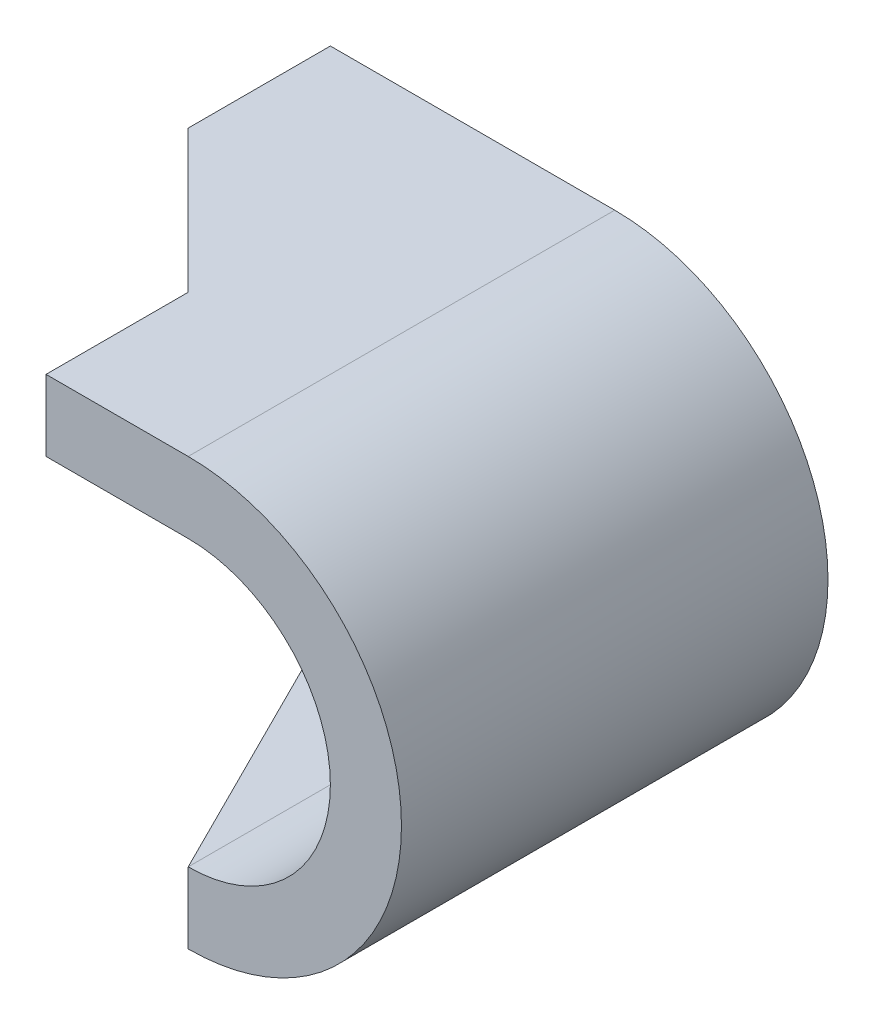
ISO-10303-21;
HEADER;
FILE_DESCRIPTION(('STEP AP214'),'2;1');
FILE_NAME('part.step','',(''),(''),'','','');
FILE_SCHEMA(('AUTOMOTIVE_DESIGN { 1 0 10303 214 1 1 1 1 }'));
ENDSEC;
DATA;
#1=APPLICATION_CONTEXT('core data for automotive mechanical design processes');
#2=APPLICATION_PROTOCOL_DEFINITION('international standard','automotive_design',2000,#1);
#3=PRODUCT_CONTEXT('',#1,'mechanical');
#4=PRODUCT('Part','Part','',(#3));
#5=PRODUCT_RELATED_PRODUCT_CATEGORY('part','',(#4));
#6=PRODUCT_DEFINITION_FORMATION('','',#4);
#7=PRODUCT_DEFINITION_CONTEXT('part definition',#1,'design');
#8=PRODUCT_DEFINITION('design','',#6,#7);
#9=PRODUCT_DEFINITION_SHAPE('','',#8);
#10=(LENGTH_UNIT() NAMED_UNIT(*) SI_UNIT(.MILLI.,.METRE.));
#11=(NAMED_UNIT(*) PLANE_ANGLE_UNIT() SI_UNIT($,.RADIAN.));
#12=(NAMED_UNIT(*) SI_UNIT($,.STERADIAN.) SOLID_ANGLE_UNIT());
#13=UNCERTAINTY_MEASURE_WITH_UNIT(LENGTH_MEASURE(1.E-05),#10,'distance_accuracy_value','');
#14=(GEOMETRIC_REPRESENTATION_CONTEXT(3) GLOBAL_UNCERTAINTY_ASSIGNED_CONTEXT((#13)) GLOBAL_UNIT_ASSIGNED_CONTEXT((#10,
#11,#12)) REPRESENTATION_CONTEXT('',''));
#15=CARTESIAN_POINT('',(0.,0.,0.));
#16=DIRECTION('',(0.,0.,1.));
#17=DIRECTION('',(1.,0.,0.));
#18=AXIS2_PLACEMENT_3D('',#15,#16,#17);
#19=CARTESIAN_POINT('',(0.,0.,6.));
#20=DIRECTION('',(0.,0.,-1.));
#21=DIRECTION('',(-1.,0.,0.));
#22=AXIS2_PLACEMENT_3D('',#19,#20,#21);
#23=CYLINDRICAL_SURFACE('',#22,2.);
#24=CARTESIAN_POINT('',(0.,0.,0.));
#25=DIRECTION('',(0.,0.,-1.));
#26=DIRECTION('',(-1.,0.,0.));
#27=AXIS2_PLACEMENT_3D('',#24,#25,#26);
#28=CIRCLE('',#27,2.);
#29=CARTESIAN_POINT('',(0.,2.,0.));
#30=VERTEX_POINT('',#29);
#31=CARTESIAN_POINT('',(0.,-2.,0.));
#32=VERTEX_POINT('',#31);
#33=EDGE_CURVE('E164',#30,#32,#28,.T.);
#34=ORIENTED_EDGE('',*,*,#33,.T.);
#35=DIRECTION('',(0.,0.,-1.));
#36=VECTOR('',#35,1.);
#37=CARTESIAN_POINT('',(0.,-2.,6.));
#38=LINE('',#37,#36);
#39=CARTESIAN_POINT('',(0.,-2.,6.));
#40=VERTEX_POINT('',#39);
#41=EDGE_CURVE('E39',#40,#32,#38,.T.);
#42=ORIENTED_EDGE('',*,*,#41,.F.);
#43=CARTESIAN_POINT('',(0.,0.,6.));
#44=DIRECTION('',(0.,0.,-1.));
#45=DIRECTION('',(-1.,0.,0.));
#46=AXIS2_PLACEMENT_3D('',#43,#44,#45);
#47=CIRCLE('',#46,2.);
#48=CARTESIAN_POINT('',(0.,2.,6.));
#49=VERTEX_POINT('',#48);
#50=EDGE_CURVE('E150',#49,#40,#47,.T.);
#51=ORIENTED_EDGE('',*,*,#50,.F.);
#52=DIRECTION('',(0.,0.,-1.));
#53=VECTOR('',#52,1.);
#54=CARTESIAN_POINT('',(0.,2.,6.));
#55=LINE('',#54,#53);
#56=EDGE_CURVE('E147',#49,#30,#55,.T.);
#57=ORIENTED_EDGE('',*,*,#56,.T.);
#58=EDGE_LOOP('',(#34,#42,#51,#57));
#59=FACE_BOUND('',#58,.T.);
#60=ADVANCED_FACE('F32',(#59),#23,.F.);
#61=CARTESIAN_POINT('',(0.,-2.,6.));
#62=DIRECTION('',(0.,-1.,0.));
#63=DIRECTION('',(1.,0.,0.));
#64=AXIS2_PLACEMENT_3D('',#61,#62,#63);
#65=PLANE('',#64);
#66=DIRECTION('',(0.,0.,-1.));
#67=VECTOR('',#66,1.);
#68=CARTESIAN_POINT('',(-2.,-2.,6.));
#69=LINE('',#68,#67);
#70=CARTESIAN_POINT('',(-2.,-2.,2.));
#71=VERTEX_POINT('',#70);
#72=CARTESIAN_POINT('',(-2.,-2.,0.));
#73=VERTEX_POINT('',#72);
#74=EDGE_CURVE('E127',#71,#73,#69,.T.);
#75=ORIENTED_EDGE('',*,*,#74,.F.);
#76=DIRECTION('',(0.447213595499958,0.,0.894427190999916));
#77=VECTOR('',#76,1.);
#78=CARTESIAN_POINT('',(0.,-2.,6.));
#79=LINE('',#78,#77);
#80=EDGE_CURVE('E114',#71,#40,#79,.T.);
#81=ORIENTED_EDGE('',*,*,#80,.T.);
#82=ORIENTED_EDGE('',*,*,#41,.T.);
#83=DIRECTION('',(-1.,0.,0.));
#84=VECTOR('',#83,1.);
#85=CARTESIAN_POINT('',(0.,-2.,0.));
#86=LINE('',#85,#84);
#87=EDGE_CURVE('E132',#32,#73,#86,.T.);
#88=ORIENTED_EDGE('',*,*,#87,.T.);
#89=EDGE_LOOP('',(#75,#81,#82,#88));
#90=FACE_BOUND('',#89,.T.);
#91=ADVANCED_FACE('F131',(#90),#65,.F.);
#92=CARTESIAN_POINT('',(-2.,-2.,6.));
#93=DIRECTION('',(1.,0.,0.));
#94=DIRECTION('',(0.,1.,0.));
#95=AXIS2_PLACEMENT_3D('',#92,#93,#94);
#96=PLANE('',#95);
#97=DIRECTION('',(0.,0.,-1.));
#98=VECTOR('',#97,1.);
#99=CARTESIAN_POINT('',(-2.,-3.,6.));
#100=LINE('',#99,#98);
#101=CARTESIAN_POINT('',(-2.,-3.,2.));
#102=VERTEX_POINT('',#101);
#103=CARTESIAN_POINT('',(-2.,-3.,0.));
#104=VERTEX_POINT('',#103);
#105=EDGE_CURVE('E129',#102,#104,#100,.T.);
#106=ORIENTED_EDGE('',*,*,#105,.F.);
#107=DIRECTION('',(0.,-1.,0.));
#108=VECTOR('',#107,1.);
#109=CARTESIAN_POINT('',(-2.,-2.,2.));
#110=LINE('',#109,#108);
#111=EDGE_CURVE('E117',#71,#102,#110,.T.);
#112=ORIENTED_EDGE('',*,*,#111,.F.);
#113=ORIENTED_EDGE('',*,*,#74,.T.);
#114=DIRECTION('',(0.,-1.,0.));
#115=VECTOR('',#114,1.);
#116=CARTESIAN_POINT('',(-2.,-2.,0.));
#117=LINE('',#116,#115);
#118=EDGE_CURVE('E161',#73,#104,#117,.T.);
#119=ORIENTED_EDGE('',*,*,#118,.T.);
#120=EDGE_LOOP('',(#106,#112,#113,#119));
#121=FACE_BOUND('',#120,.T.);
#122=ADVANCED_FACE('F125',(#121),#96,.F.);
#123=CARTESIAN_POINT('',(-2.,-3.,6.));
#124=DIRECTION('',(0.,1.,0.));
#125=DIRECTION('',(-1.,0.,0.));
#126=AXIS2_PLACEMENT_3D('',#123,#124,#125);
#127=PLANE('',#126);
#128=DIRECTION('',(0.,0.,-1.));
#129=VECTOR('',#128,1.);
#130=CARTESIAN_POINT('',(0.,-3.,6.));
#131=LINE('',#130,#129);
#132=CARTESIAN_POINT('',(0.,-3.,6.));
#133=VERTEX_POINT('',#132);
#134=CARTESIAN_POINT('',(0.,-3.,0.));
#135=VERTEX_POINT('',#134);
#136=EDGE_CURVE('E135',#133,#135,#131,.T.);
#137=ORIENTED_EDGE('',*,*,#136,.F.);
#138=DIRECTION('',(0.447213595499958,0.,0.894427190999916));
#139=VECTOR('',#138,1.);
#140=CARTESIAN_POINT('',(0.,-3.,6.));
#141=LINE('',#140,#139);
#142=EDGE_CURVE('E92',#102,#133,#141,.T.);
#143=ORIENTED_EDGE('',*,*,#142,.F.);
#144=ORIENTED_EDGE('',*,*,#105,.T.);
#145=DIRECTION('',(1.,0.,0.));
#146=VECTOR('',#145,1.);
#147=CARTESIAN_POINT('',(-2.,-3.,0.));
#148=LINE('',#147,#146);
#149=EDGE_CURVE('E159',#104,#135,#148,.T.);
#150=ORIENTED_EDGE('',*,*,#149,.T.);
#151=EDGE_LOOP('',(#137,#143,#144,#150));
#152=FACE_BOUND('',#151,.T.);
#153=ADVANCED_FACE('F196',(#152),#127,.F.);
#154=CARTESIAN_POINT('',(0.,0.,6.));
#155=DIRECTION('',(0.,0.,-1.));
#156=DIRECTION('',(-1.,0.,0.));
#157=AXIS2_PLACEMENT_3D('',#154,#155,#156);
#158=CYLINDRICAL_SURFACE('',#157,3.);
#159=CARTESIAN_POINT('',(0.,0.,0.));
#160=DIRECTION('',(0.,0.,1.));
#161=DIRECTION('',(-1.,0.,0.));
#162=AXIS2_PLACEMENT_3D('',#159,#160,#161);
#163=CIRCLE('',#162,3.);
#164=CARTESIAN_POINT('',(0.,3.,0.));
#165=VERTEX_POINT('',#164);
#166=EDGE_CURVE('E157',#135,#165,#163,.T.);
#167=ORIENTED_EDGE('',*,*,#166,.T.);
#168=DIRECTION('',(0.,0.,-1.));
#169=VECTOR('',#168,1.);
#170=CARTESIAN_POINT('',(0.,3.,6.));
#171=LINE('',#170,#169);
#172=CARTESIAN_POINT('',(0.,3.,6.));
#173=VERTEX_POINT('',#172);
#174=EDGE_CURVE('E140',#173,#165,#171,.T.);
#175=ORIENTED_EDGE('',*,*,#174,.F.);
#176=CARTESIAN_POINT('',(0.,0.,6.));
#177=DIRECTION('',(0.,0.,1.));
#178=DIRECTION('',(-1.,0.,0.));
#179=AXIS2_PLACEMENT_3D('',#176,#177,#178);
#180=CIRCLE('',#179,3.);
#181=EDGE_CURVE('E172',#133,#173,#180,.T.);
#182=ORIENTED_EDGE('',*,*,#181,.F.);
#183=ORIENTED_EDGE('',*,*,#136,.T.);
#184=EDGE_LOOP('',(#167,#175,#182,#183));
#185=FACE_BOUND('',#184,.T.);
#186=ADVANCED_FACE('F200',(#185),#158,.T.);
#187=CARTESIAN_POINT('',(-4.,3.,6.));
#188=DIRECTION('',(0.,-1.,0.));
#189=DIRECTION('',(1.,0.,0.));
#190=AXIS2_PLACEMENT_3D('',#187,#188,#189);
#191=PLANE('',#190);
#192=DIRECTION('',(0.707106781186547,0.,0.707106781186548));
#193=VECTOR('',#192,1.);
#194=CARTESIAN_POINT('',(-2.,3.,4.));
#195=LINE('',#194,#193);
#196=CARTESIAN_POINT('',(-4.,3.,2.));
#197=VERTEX_POINT('',#196);
#198=CARTESIAN_POINT('',(-2.,3.,4.));
#199=VERTEX_POINT('',#198);
#200=EDGE_CURVE('E167',#197,#199,#195,.T.);
#201=ORIENTED_EDGE('',*,*,#200,.T.);
#202=DIRECTION('',(0.,0.,1.));
#203=VECTOR('',#202,1.);
#204=CARTESIAN_POINT('',(-2.,3.,6.));
#205=LINE('',#204,#203);
#206=CARTESIAN_POINT('',(-2.,3.,6.));
#207=VERTEX_POINT('',#206);
#208=EDGE_CURVE('E177',#199,#207,#205,.T.);
#209=ORIENTED_EDGE('',*,*,#208,.T.);
#210=DIRECTION('',(-1.,0.,0.));
#211=VECTOR('',#210,1.);
#212=CARTESIAN_POINT('',(-4.,3.,6.));
#213=LINE('',#212,#211);
#214=EDGE_CURVE('E169',#173,#207,#213,.T.);
#215=ORIENTED_EDGE('',*,*,#214,.F.);
#216=ORIENTED_EDGE('',*,*,#174,.T.);
#217=DIRECTION('',(-1.,0.,0.));
#218=VECTOR('',#217,1.);
#219=CARTESIAN_POINT('',(-4.,3.,0.));
#220=LINE('',#219,#218);
#221=CARTESIAN_POINT('',(-4.,3.,0.));
#222=VERTEX_POINT('',#221);
#223=EDGE_CURVE('E154',#165,#222,#220,.T.);
#224=ORIENTED_EDGE('',*,*,#223,.T.);
#225=DIRECTION('',(0.,0.,-1.));
#226=VECTOR('',#225,1.);
#227=CARTESIAN_POINT('',(-4.,3.,6.));
#228=LINE('',#227,#226);
#229=EDGE_CURVE('E143',#197,#222,#228,.T.);
#230=ORIENTED_EDGE('',*,*,#229,.F.);
#231=EDGE_LOOP('',(#201,#209,#215,#216,#224,#230));
#232=FACE_BOUND('',#231,.T.);
#233=ADVANCED_FACE('F204',(#232),#191,.F.);
#234=CARTESIAN_POINT('',(-4.,2.,6.));
#235=DIRECTION('',(1.,0.,0.));
#236=DIRECTION('',(0.,0.,-1.));
#237=AXIS2_PLACEMENT_3D('',#234,#235,#236);
#238=PLANE('',#237);
#239=DIRECTION('',(0.,0.,-1.));
#240=VECTOR('',#239,1.);
#241=CARTESIAN_POINT('',(-4.,2.,6.));
#242=LINE('',#241,#240);
#243=CARTESIAN_POINT('',(-4.,2.,2.));
#244=VERTEX_POINT('',#243);
#245=CARTESIAN_POINT('',(-4.,2.,0.));
#246=VERTEX_POINT('',#245);
#247=EDGE_CURVE('E145',#244,#246,#242,.T.);
#248=ORIENTED_EDGE('',*,*,#247,.F.);
#249=DIRECTION('',(0.,-1.,0.));
#250=VECTOR('',#249,1.);
#251=CARTESIAN_POINT('',(-4.,8.,2.));
#252=LINE('',#251,#250);
#253=EDGE_CURVE('E181',#197,#244,#252,.T.);
#254=ORIENTED_EDGE('',*,*,#253,.F.);
#255=ORIENTED_EDGE('',*,*,#229,.T.);
#256=DIRECTION('',(0.,-1.,0.));
#257=VECTOR('',#256,1.);
#258=CARTESIAN_POINT('',(-4.,2.,0.));
#259=LINE('',#258,#257);
#260=EDGE_CURVE('E151',#222,#246,#259,.T.);
#261=ORIENTED_EDGE('',*,*,#260,.T.);
#262=EDGE_LOOP('',(#248,#254,#255,#261));
#263=FACE_BOUND('',#262,.T.);
#264=ADVANCED_FACE('F216',(#263),#238,.F.);
#265=CARTESIAN_POINT('',(0.,2.,6.));
#266=DIRECTION('',(0.,1.,0.));
#267=DIRECTION('',(-1.,0.,0.));
#268=AXIS2_PLACEMENT_3D('',#265,#266,#267);
#269=PLANE('',#268);
#270=DIRECTION('',(1.,0.,0.));
#271=VECTOR('',#270,1.);
#272=CARTESIAN_POINT('',(0.,2.,6.));
#273=LINE('',#272,#271);
#274=CARTESIAN_POINT('',(-2.,2.,6.));
#275=VERTEX_POINT('',#274);
#276=EDGE_CURVE('E53',#275,#49,#273,.T.);
#277=ORIENTED_EDGE('',*,*,#276,.F.);
#278=DIRECTION('',(0.,0.,1.));
#279=VECTOR('',#278,1.);
#280=CARTESIAN_POINT('',(-2.,2.,6.));
#281=LINE('',#280,#279);
#282=CARTESIAN_POINT('',(-2.,2.,4.));
#283=VERTEX_POINT('',#282);
#284=EDGE_CURVE('E46',#283,#275,#281,.T.);
#285=ORIENTED_EDGE('',*,*,#284,.F.);
#286=DIRECTION('',(0.707106781186547,0.,0.707106781186548));
#287=VECTOR('',#286,1.);
#288=CARTESIAN_POINT('',(-2.,2.,4.));
#289=LINE('',#288,#287);
#290=EDGE_CURVE('E185',#244,#283,#289,.T.);
#291=ORIENTED_EDGE('',*,*,#290,.F.);
#292=ORIENTED_EDGE('',*,*,#247,.T.);
#293=DIRECTION('',(1.,0.,0.));
#294=VECTOR('',#293,1.);
#295=CARTESIAN_POINT('',(0.,2.,0.));
#296=LINE('',#295,#294);
#297=EDGE_CURVE('E85',#246,#30,#296,.T.);
#298=ORIENTED_EDGE('',*,*,#297,.T.);
#299=ORIENTED_EDGE('',*,*,#56,.F.);
#300=EDGE_LOOP('',(#277,#285,#291,#292,#298,#299));
#301=FACE_BOUND('',#300,.T.);
#302=ADVANCED_FACE('F205',(#301),#269,.F.);
#303=CARTESIAN_POINT('',(0.,0.,6.));
#304=DIRECTION('',(0.,0.,-1.));
#305=DIRECTION('',(-1.,0.,0.));
#306=AXIS2_PLACEMENT_3D('',#303,#304,#305);
#307=PLANE('',#306);
#308=ORIENTED_EDGE('',*,*,#50,.T.);
#309=DIRECTION('',(0.,-1.,0.));
#310=VECTOR('',#309,1.);
#311=CARTESIAN_POINT('',(0.,-2.,6.));
#312=LINE('',#311,#310);
#313=EDGE_CURVE('E118',#40,#133,#312,.T.);
#314=ORIENTED_EDGE('',*,*,#313,.T.);
#315=ORIENTED_EDGE('',*,*,#181,.T.);
#316=ORIENTED_EDGE('',*,*,#214,.T.);
#317=DIRECTION('',(0.,-1.,0.));
#318=VECTOR('',#317,1.);
#319=CARTESIAN_POINT('',(-2.,0.,6.));
#320=LINE('',#319,#318);
#321=EDGE_CURVE('E11',#207,#275,#320,.T.);
#322=ORIENTED_EDGE('',*,*,#321,.T.);
#323=ORIENTED_EDGE('',*,*,#276,.T.);
#324=EDGE_LOOP('',(#308,#314,#315,#316,#322,#323));
#325=FACE_BOUND('',#324,.T.);
#326=ADVANCED_FACE('F190',(#325),#307,.F.);
#327=CARTESIAN_POINT('',(0.,0.,0.));
#328=DIRECTION('',(0.,0.,-1.));
#329=DIRECTION('',(-1.,0.,0.));
#330=AXIS2_PLACEMENT_3D('',#327,#328,#329);
#331=PLANE('',#330);
#332=ORIENTED_EDGE('',*,*,#33,.F.);
#333=ORIENTED_EDGE('',*,*,#297,.F.);
#334=ORIENTED_EDGE('',*,*,#260,.F.);
#335=ORIENTED_EDGE('',*,*,#223,.F.);
#336=ORIENTED_EDGE('',*,*,#166,.F.);
#337=ORIENTED_EDGE('',*,*,#149,.F.);
#338=ORIENTED_EDGE('',*,*,#118,.F.);
#339=ORIENTED_EDGE('',*,*,#87,.F.);
#340=EDGE_LOOP('',(#332,#333,#334,#335,#336,#337,#338,#339));
#341=FACE_BOUND('',#340,.T.);
#342=ADVANCED_FACE('F210',(#341),#331,.T.);
#343=CARTESIAN_POINT('',(-2.,8.,4.));
#344=DIRECTION('',(0.707106781186548,0.,-0.707106781186547));
#345=DIRECTION('',(-0.707106781186547,0.,-0.707106781186548));
#346=AXIS2_PLACEMENT_3D('',#343,#344,#345);
#347=PLANE('',#346);
#348=ORIENTED_EDGE('',*,*,#253,.T.);
#349=ORIENTED_EDGE('',*,*,#290,.T.);
#350=DIRECTION('',(0.,-1.,0.));
#351=VECTOR('',#350,1.);
#352=CARTESIAN_POINT('',(-2.,8.,4.));
#353=LINE('',#352,#351);
#354=EDGE_CURVE('E180',#199,#283,#353,.T.);
#355=ORIENTED_EDGE('',*,*,#354,.F.);
#356=ORIENTED_EDGE('',*,*,#200,.F.);
#357=EDGE_LOOP('',(#348,#349,#355,#356));
#358=FACE_BOUND('',#357,.T.);
#359=ADVANCED_FACE('F218',(#358),#347,.F.);
#360=CARTESIAN_POINT('',(-2.,8.,6.));
#361=DIRECTION('',(1.,0.,0.));
#362=DIRECTION('',(0.,1.,0.));
#363=AXIS2_PLACEMENT_3D('',#360,#361,#362);
#364=PLANE('',#363);
#365=ORIENTED_EDGE('',*,*,#354,.T.);
#366=ORIENTED_EDGE('',*,*,#284,.T.);
#367=ORIENTED_EDGE('',*,*,#321,.F.);
#368=ORIENTED_EDGE('',*,*,#208,.F.);
#369=EDGE_LOOP('',(#365,#366,#367,#368));
#370=FACE_BOUND('',#369,.T.);
#371=ADVANCED_FACE('F220',(#370),#364,.F.);
#372=CARTESIAN_POINT('',(0.,-2.,6.));
#373=DIRECTION('',(0.894427190999916,0.,-0.447213595499958));
#374=DIRECTION('',(-0.447213595499958,0.,-0.894427190999916));
#375=AXIS2_PLACEMENT_3D('',#372,#373,#374);
#376=PLANE('',#375);
#377=ORIENTED_EDGE('',*,*,#142,.T.);
#378=ORIENTED_EDGE('',*,*,#313,.F.);
#379=ORIENTED_EDGE('',*,*,#80,.F.);
#380=ORIENTED_EDGE('',*,*,#111,.T.);
#381=EDGE_LOOP('',(#377,#378,#379,#380));
#382=FACE_BOUND('',#381,.T.);
#383=ADVANCED_FACE('F116',(#382),#376,.F.);
#384=CLOSED_SHELL('',(#60,#91,#122,#153,#186,#233,#264,#302,#326,#342,#359,#371,#383));
#385=MANIFOLD_SOLID_BREP('B2',#384);
#386=ADVANCED_BREP_SHAPE_REPRESENTATION('',(#18,#385),#14);
#387=SHAPE_DEFINITION_REPRESENTATION(#9,#386);
ENDSEC;
END-ISO-10303-21;
